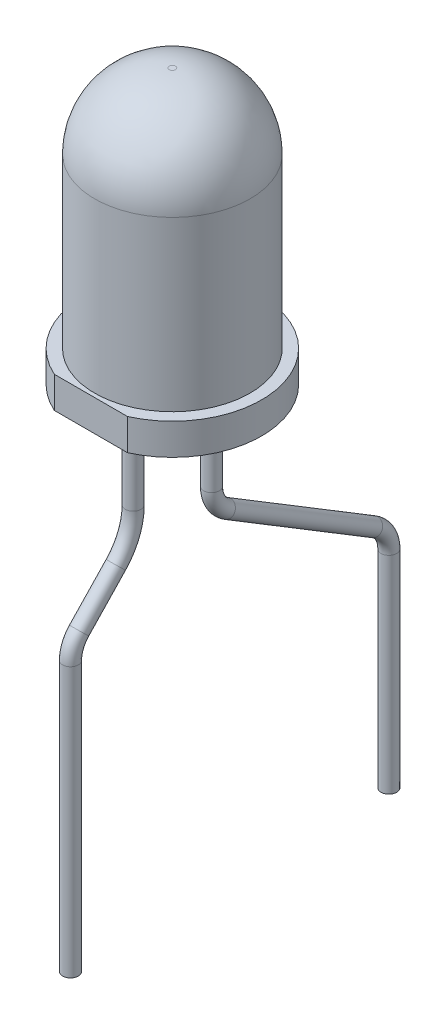
ISO-10303-21;
HEADER;
FILE_DESCRIPTION(('STEP AP214'),'2;1');
FILE_NAME('part.step','',(''),(''),'','','');
FILE_SCHEMA(('AUTOMOTIVE_DESIGN { 1 0 10303 214 1 1 1 1 }'));
ENDSEC;
DATA;
#1=APPLICATION_CONTEXT('core data for automotive mechanical design processes');
#2=APPLICATION_PROTOCOL_DEFINITION('international standard','automotive_design',2000,#1);
#3=PRODUCT_CONTEXT('',#1,'mechanical');
#4=PRODUCT('Part','Part','',(#3));
#5=PRODUCT_RELATED_PRODUCT_CATEGORY('part','',(#4));
#6=PRODUCT_DEFINITION_FORMATION('','',#4);
#7=PRODUCT_DEFINITION_CONTEXT('part definition',#1,'design');
#8=PRODUCT_DEFINITION('design','',#6,#7);
#9=PRODUCT_DEFINITION_SHAPE('','',#8);
#10=(LENGTH_UNIT() NAMED_UNIT(*) SI_UNIT(.MILLI.,.METRE.));
#11=(NAMED_UNIT(*) PLANE_ANGLE_UNIT() SI_UNIT($,.RADIAN.));
#12=(NAMED_UNIT(*) SI_UNIT($,.STERADIAN.) SOLID_ANGLE_UNIT());
#13=UNCERTAINTY_MEASURE_WITH_UNIT(LENGTH_MEASURE(1.E-05),#10,'distance_accuracy_value','');
#14=(GEOMETRIC_REPRESENTATION_CONTEXT(3) GLOBAL_UNCERTAINTY_ASSIGNED_CONTEXT((#13)) GLOBAL_UNIT_ASSIGNED_CONTEXT((#10,
#11,#12)) REPRESENTATION_CONTEXT('',''));
#15=CARTESIAN_POINT('',(0.,0.,0.));
#16=DIRECTION('',(0.,0.,1.));
#17=DIRECTION('',(1.,0.,0.));
#18=AXIS2_PLACEMENT_3D('',#15,#16,#17);
#19=CARTESIAN_POINT('',(0.,0.,0.));
#20=DIRECTION('',(0.,-1.,0.));
#21=DIRECTION('',(0.,0.,-1.));
#22=AXIS2_PLACEMENT_3D('',#19,#20,#21);
#23=PLANE('',#22);
#24=CARTESIAN_POINT('',(0.,0.,1.25));
#25=DIRECTION('',(0.,-1.,0.));
#26=DIRECTION('',(0.,0.,-1.));
#27=AXIS2_PLACEMENT_3D('',#24,#25,#26);
#28=CIRCLE('',#27,0.25);
#29=CARTESIAN_POINT('',(0.,0.,1.));
#30=VERTEX_POINT('',#29);
#31=EDGE_CURVE('E89',#30,#30,#28,.T.);
#32=ORIENTED_EDGE('',*,*,#31,.F.);
#33=EDGE_LOOP('',(#32));
#34=FACE_BOUND('',#33,.T.);
#35=CARTESIAN_POINT('',(0.,0.,-1.25));
#36=DIRECTION('',(0.,-1.,0.));
#37=DIRECTION('',(0.,0.,-1.));
#38=AXIS2_PLACEMENT_3D('',#35,#36,#37);
#39=CIRCLE('',#38,0.25);
#40=CARTESIAN_POINT('',(0.,0.,-1.5));
#41=VERTEX_POINT('',#40);
#42=EDGE_CURVE('E86',#41,#41,#39,.T.);
#43=ORIENTED_EDGE('',*,*,#42,.F.);
#44=EDGE_LOOP('',(#43));
#45=FACE_BOUND('',#44,.T.);
#46=DIRECTION('',(1.,0.,0.));
#47=VECTOR('',#46,1.);
#48=CARTESIAN_POINT('',(-1.16726175299288,0.,2.6));
#49=LINE('',#48,#47);
#50=CARTESIAN_POINT('',(-1.16726175299288,0.,2.6));
#51=VERTEX_POINT('',#50);
#52=CARTESIAN_POINT('',(1.16726175299288,0.,2.6));
#53=VERTEX_POINT('',#52);
#54=EDGE_CURVE('E66',#51,#53,#49,.T.);
#55=ORIENTED_EDGE('',*,*,#54,.F.);
#56=CARTESIAN_POINT('',(0.,0.,0.));
#57=DIRECTION('',(0.,-1.,0.));
#58=DIRECTION('',(0.,0.,-1.));
#59=AXIS2_PLACEMENT_3D('',#56,#57,#58);
#60=CIRCLE('',#59,2.85);
#61=EDGE_CURVE('E11',#51,#53,#60,.T.);
#62=ORIENTED_EDGE('',*,*,#61,.T.);
#63=EDGE_LOOP('',(#55,#62));
#64=FACE_BOUND('',#63,.T.);
#65=ADVANCED_FACE('F37',(#34,#45,#64),#23,.T.);
#66=CARTESIAN_POINT('',(0.,0.,0.));
#67=DIRECTION('',(0.,-1.,0.));
#68=DIRECTION('',(0.,0.,-1.));
#69=AXIS2_PLACEMENT_3D('',#66,#67,#68);
#70=CYLINDRICAL_SURFACE('',#69,2.85);
#71=DIRECTION('',(0.,-1.,0.));
#72=VECTOR('',#71,1.);
#73=CARTESIAN_POINT('',(1.16726175299288,3.34787137637478,2.6));
#74=LINE('',#73,#72);
#75=CARTESIAN_POINT('',(1.16726175299288,1.,2.6));
#76=VERTEX_POINT('',#75);
#77=EDGE_CURVE('E51',#76,#53,#74,.T.);
#78=ORIENTED_EDGE('',*,*,#77,.T.);
#79=ORIENTED_EDGE('',*,*,#61,.F.);
#80=DIRECTION('',(0.,-1.,0.));
#81=VECTOR('',#80,1.);
#82=CARTESIAN_POINT('',(-1.16726175299288,3.34787137637478,2.6));
#83=LINE('',#82,#81);
#84=CARTESIAN_POINT('',(-1.16726175299288,1.,2.6));
#85=VERTEX_POINT('',#84);
#86=EDGE_CURVE('E57',#85,#51,#83,.T.);
#87=ORIENTED_EDGE('',*,*,#86,.F.);
#88=CARTESIAN_POINT('',(0.,1.,0.));
#89=DIRECTION('',(0.,-1.,0.));
#90=DIRECTION('',(0.,0.,-1.));
#91=AXIS2_PLACEMENT_3D('',#88,#89,#90);
#92=CIRCLE('',#91,2.85);
#93=EDGE_CURVE('E44',#85,#76,#92,.T.);
#94=ORIENTED_EDGE('',*,*,#93,.T.);
#95=EDGE_LOOP('',(#78,#79,#87,#94));
#96=FACE_BOUND('',#95,.T.);
#97=ADVANCED_FACE('F70',(#96),#70,.T.);
#98=CARTESIAN_POINT('',(2.85,1.,0.));
#99=DIRECTION('',(0.,1.,0.));
#100=DIRECTION('',(0.,0.,1.));
#101=AXIS2_PLACEMENT_3D('',#98,#99,#100);
#102=PLANE('',#101);
#103=DIRECTION('',(1.,0.,0.));
#104=VECTOR('',#103,1.);
#105=CARTESIAN_POINT('',(-1.16726175299288,1.,2.6));
#106=LINE('',#105,#104);
#107=EDGE_CURVE('E61',#85,#76,#106,.T.);
#108=ORIENTED_EDGE('',*,*,#107,.T.);
#109=ORIENTED_EDGE('',*,*,#93,.F.);
#110=EDGE_LOOP('',(#108,#109));
#111=FACE_BOUND('',#110,.T.);
#112=CARTESIAN_POINT('',(0.,1.,0.));
#113=DIRECTION('',(0.,-1.,0.));
#114=DIRECTION('',(0.,0.,-1.));
#115=AXIS2_PLACEMENT_3D('',#112,#113,#114);
#116=CIRCLE('',#115,2.48);
#117=CARTESIAN_POINT('',(0.,1.,-2.48));
#118=VERTEX_POINT('',#117);
#119=EDGE_CURVE('E75',#118,#118,#116,.T.);
#120=ORIENTED_EDGE('',*,*,#119,.T.);
#121=EDGE_LOOP('',(#120));
#122=FACE_BOUND('',#121,.T.);
#123=ADVANCED_FACE('F73',(#111,#122),#102,.T.);
#124=CARTESIAN_POINT('',(0.,0.,0.));
#125=DIRECTION('',(0.,-1.,0.));
#126=DIRECTION('',(0.,0.,-1.));
#127=AXIS2_PLACEMENT_3D('',#124,#125,#126);
#128=CYLINDRICAL_SURFACE('',#127,2.48);
#129=CARTESIAN_POINT('',(0.,6.37,0.));
#130=DIRECTION('',(0.,-1.,0.));
#131=DIRECTION('',(0.,0.,-1.));
#132=AXIS2_PLACEMENT_3D('',#129,#130,#131);
#133=CIRCLE('',#132,2.48);
#134=CARTESIAN_POINT('',(0.,6.37,-2.48));
#135=VERTEX_POINT('',#134);
#136=EDGE_CURVE('E77',#135,#135,#133,.T.);
#137=ORIENTED_EDGE('',*,*,#136,.T.);
#138=EDGE_LOOP('',(#137));
#139=FACE_BOUND('',#138,.T.);
#140=ORIENTED_EDGE('',*,*,#119,.F.);
#141=EDGE_LOOP('',(#140));
#142=FACE_BOUND('',#141,.T.);
#143=ADVANCED_FACE('F294',(#139,#142),#128,.T.);
#144=CARTESIAN_POINT('',(0.,6.37,0.));
#145=DIRECTION('',(0.,-1.,0.));
#146=DIRECTION('',(0.,0.,-1.));
#147=AXIS2_PLACEMENT_3D('',#144,#145,#146);
#148=DEGENERATE_TOROIDAL_SURFACE('',#147,0.1,2.38,.T.);
#149=CARTESIAN_POINT('',(0.,8.75,0.));
#150=DIRECTION('',(0.,-1.,0.));
#151=DIRECTION('',(0.,0.,-1.));
#152=AXIS2_PLACEMENT_3D('',#149,#150,#151);
#153=CIRCLE('',#152,0.1);
#154=CARTESIAN_POINT('',(0.,8.75,-0.1));
#155=VERTEX_POINT('',#154);
#156=EDGE_CURVE('E71',#155,#155,#153,.T.);
#157=ORIENTED_EDGE('',*,*,#156,.T.);
#158=EDGE_LOOP('',(#157));
#159=FACE_BOUND('',#158,.T.);
#160=ORIENTED_EDGE('',*,*,#136,.F.);
#161=EDGE_LOOP('',(#160));
#162=FACE_BOUND('',#161,.T.);
#163=ADVANCED_FACE('F308',(#159,#162),#148,.T.);
#164=CARTESIAN_POINT('',(0.,8.75,0.));
#165=DIRECTION('',(0.,1.,0.));
#166=DIRECTION('',(0.,0.,1.));
#167=AXIS2_PLACEMENT_3D('',#164,#165,#166);
#168=PLANE('',#167);
#169=ORIENTED_EDGE('',*,*,#156,.F.);
#170=EDGE_LOOP('',(#169));
#171=FACE_BOUND('',#170,.T.);
#172=ADVANCED_FACE('F138',(#171),#168,.T.);
#173=CARTESIAN_POINT('',(-1.16726175299288,3.34787137637478,2.6));
#174=DIRECTION('',(0.,0.,-1.));
#175=DIRECTION('',(-1.,0.,0.));
#176=AXIS2_PLACEMENT_3D('',#173,#174,#175);
#177=PLANE('',#176);
#178=ORIENTED_EDGE('',*,*,#86,.T.);
#179=ORIENTED_EDGE('',*,*,#54,.T.);
#180=ORIENTED_EDGE('',*,*,#77,.F.);
#181=ORIENTED_EDGE('',*,*,#107,.F.);
#182=EDGE_LOOP('',(#178,#179,#180,#181));
#183=FACE_BOUND('',#182,.T.);
#184=ADVANCED_FACE('F62',(#183),#177,.F.);
#185=CARTESIAN_POINT('',(0.,-2.,-1.25));
#186=DIRECTION('',(0.,1.,0.));
#187=DIRECTION('',(0.,0.,1.));
#188=AXIS2_PLACEMENT_3D('',#185,#186,#187);
#189=CYLINDRICAL_SURFACE('',#188,0.25);
#190=ORIENTED_EDGE('',*,*,#42,.T.);
#191=EDGE_LOOP('',(#190));
#192=FACE_BOUND('',#191,.T.);
#193=CARTESIAN_POINT('',(0.,-3.43733882567167,-1.25));
#194=DIRECTION('',(0.,-1.,0.));
#195=DIRECTION('',(0.,0.,-1.));
#196=AXIS2_PLACEMENT_3D('',#193,#194,#195);
#197=CIRCLE('',#196,0.25);
#198=CARTESIAN_POINT('',(0.,-3.43733882567167,-1.));
#199=VERTEX_POINT('',#198);
#200=EDGE_CURVE('E119',#199,#199,#197,.T.);
#201=ORIENTED_EDGE('',*,*,#200,.F.);
#202=EDGE_LOOP('',(#201));
#203=FACE_BOUND('',#202,.T.);
#204=ADVANCED_FACE('F125',(#192,#203),#189,.T.);
#205=CARTESIAN_POINT('',(0.,-2.,1.25));
#206=DIRECTION('',(0.,1.,0.));
#207=DIRECTION('',(0.,0.,1.));
#208=AXIS2_PLACEMENT_3D('',#205,#206,#207);
#209=CYLINDRICAL_SURFACE('',#208,0.25);
#210=ORIENTED_EDGE('',*,*,#31,.T.);
#211=EDGE_LOOP('',(#210));
#212=FACE_BOUND('',#211,.T.);
#213=CARTESIAN_POINT('',(0.,-2.7,1.25));
#214=DIRECTION('',(0.,-1.,0.));
#215=DIRECTION('',(0.,0.,-1.));
#216=AXIS2_PLACEMENT_3D('',#213,#214,#215);
#217=CIRCLE('',#216,0.25);
#218=CARTESIAN_POINT('',(0.,-2.7,1.));
#219=VERTEX_POINT('',#218);
#220=EDGE_CURVE('E104',#219,#219,#217,.T.);
#221=ORIENTED_EDGE('',*,*,#220,.F.);
#222=EDGE_LOOP('',(#221));
#223=FACE_BOUND('',#222,.T.);
#224=ADVANCED_FACE('F127',(#212,#223),#209,.T.);
#225=CARTESIAN_POINT('',(0.,-14.6,3.25));
#226=DIRECTION('',(0.,-1.,0.));
#227=DIRECTION('',(0.,0.,-1.));
#228=AXIS2_PLACEMENT_3D('',#225,#226,#227);
#229=PLANE('',#228);
#230=CARTESIAN_POINT('',(0.,-14.6,3.25));
#231=DIRECTION('',(0.,-1.,0.));
#232=DIRECTION('',(0.,0.,-1.));
#233=AXIS2_PLACEMENT_3D('',#230,#231,#232);
#234=CIRCLE('',#233,0.25);
#235=CARTESIAN_POINT('',(0.,-14.6,3.));
#236=VERTEX_POINT('',#235);
#237=EDGE_CURVE('E92',#236,#236,#234,.T.);
#238=ORIENTED_EDGE('',*,*,#237,.T.);
#239=EDGE_LOOP('',(#238));
#240=FACE_BOUND('',#239,.T.);
#241=ADVANCED_FACE('F134',(#240),#229,.T.);
#242=CARTESIAN_POINT('',(0.,-2.7,3.25));
#243=DIRECTION('',(-1.,0.,0.));
#244=DIRECTION('',(0.,0.,1.));
#245=AXIS2_PLACEMENT_3D('',#242,#243,#244);
#246=TOROIDAL_SURFACE('',#245,2.,0.25);
#247=CARTESIAN_POINT('',(0.,-4.07931034482759,1.80172413793103));
#248=DIRECTION('',(0.,-0.724137931034485,0.689655172413791));
#249=DIRECTION('',(0.,-0.689655172413791,-0.724137931034485));
#250=AXIS2_PLACEMENT_3D('',#247,#248,#249);
#251=CIRCLE('',#250,0.25);
#252=CARTESIAN_POINT('',(0.,-4.25172413793103,1.62068965517241));
#253=VERTEX_POINT('',#252);
#254=EDGE_CURVE('E101',#253,#253,#251,.T.);
#255=CARTESIAN_POINT('',(0.,-2.7,3.25));
#256=DIRECTION('',(-1.,0.,0.));
#257=DIRECTION('',(0.,0.,1.));
#258=AXIS2_PLACEMENT_3D('',#255,#256,#257);
#259=CIRCLE('',#258,2.25);
#260=EDGE_CURVE('',#219,#253,#259,.T.);
#261=ORIENTED_EDGE('',*,*,#220,.T.);
#262=ORIENTED_EDGE('',*,*,#254,.F.);
#263=ORIENTED_EDGE('',*,*,#260,.T.);
#264=ORIENTED_EDGE('',*,*,#260,.F.);
#265=EDGE_LOOP('',(#261,#263,#262,#264));
#266=FACE_BOUND('',#265,.T.);
#267=ADVANCED_FACE('F152',(#266),#246,.T.);
#268=CARTESIAN_POINT('',(0.,-4.07931034482759,1.80172413793103));
#269=DIRECTION('',(0.,-0.724137931034485,0.689655172413791));
#270=DIRECTION('',(0.,-0.689655172413791,-0.724137931034485));
#271=AXIS2_PLACEMENT_3D('',#268,#269,#270);
#272=CYLINDRICAL_SURFACE('',#271,0.25);
#273=CARTESIAN_POINT('',(0.,-5.31034482758622,2.97413793103448));
#274=DIRECTION('',(0.,-0.724137931034485,0.689655172413791));
#275=DIRECTION('',(0.,-0.689655172413791,-0.724137931034485));
#276=AXIS2_PLACEMENT_3D('',#273,#274,#275);
#277=CIRCLE('',#276,0.25);
#278=CARTESIAN_POINT('',(0.,-5.13793103448277,3.1551724137931));
#279=VERTEX_POINT('',#278);
#280=EDGE_CURVE('E98',#279,#279,#277,.T.);
#281=ORIENTED_EDGE('',*,*,#280,.F.);
#282=EDGE_LOOP('',(#281));
#283=FACE_BOUND('',#282,.T.);
#284=ORIENTED_EDGE('',*,*,#254,.T.);
#285=EDGE_LOOP('',(#284));
#286=FACE_BOUND('',#285,.T.);
#287=ADVANCED_FACE('F154',(#283,#286),#272,.T.);
#288=CARTESIAN_POINT('',(0.,-6.00000000000001,2.25));
#289=DIRECTION('',(1.,0.,0.));
#290=DIRECTION('',(0.,0.,-1.));
#291=AXIS2_PLACEMENT_3D('',#288,#289,#290);
#292=TOROIDAL_SURFACE('',#291,0.999999999999997,0.25);
#293=CARTESIAN_POINT('',(0.,-6.00000000000001,3.25));
#294=DIRECTION('',(0.,-1.,0.));
#295=DIRECTION('',(0.,0.,-1.));
#296=AXIS2_PLACEMENT_3D('',#293,#294,#295);
#297=CIRCLE('',#296,0.25);
#298=CARTESIAN_POINT('',(0.,-6.00000000000001,3.5));
#299=VERTEX_POINT('',#298);
#300=EDGE_CURVE('E95',#299,#299,#297,.T.);
#301=CARTESIAN_POINT('',(0.,-6.00000000000001,2.25));
#302=DIRECTION('',(1.,0.,0.));
#303=DIRECTION('',(0.,0.,-1.));
#304=AXIS2_PLACEMENT_3D('',#301,#302,#303);
#305=CIRCLE('',#304,1.25);
#306=EDGE_CURVE('',#279,#299,#305,.T.);
#307=ORIENTED_EDGE('',*,*,#280,.T.);
#308=ORIENTED_EDGE('',*,*,#300,.F.);
#309=ORIENTED_EDGE('',*,*,#306,.T.);
#310=ORIENTED_EDGE('',*,*,#306,.F.);
#311=EDGE_LOOP('',(#307,#309,#308,#310));
#312=FACE_BOUND('',#311,.T.);
#313=ADVANCED_FACE('F161',(#312),#292,.T.);
#314=CARTESIAN_POINT('',(0.,-6.00000000000001,3.25));
#315=DIRECTION('',(0.,-1.,0.));
#316=DIRECTION('',(0.,0.,-1.));
#317=AXIS2_PLACEMENT_3D('',#314,#315,#316);
#318=CYLINDRICAL_SURFACE('',#317,0.25);
#319=ORIENTED_EDGE('',*,*,#237,.F.);
#320=EDGE_LOOP('',(#319));
#321=FACE_BOUND('',#320,.T.);
#322=ORIENTED_EDGE('',*,*,#300,.T.);
#323=EDGE_LOOP('',(#322));
#324=FACE_BOUND('',#323,.T.);
#325=ADVANCED_FACE('F137',(#321,#324),#318,.T.);
#326=CARTESIAN_POINT('',(0.,-14.6,-6.91));
#327=DIRECTION('',(0.,-1.,0.));
#328=DIRECTION('',(0.,0.,-1.));
#329=AXIS2_PLACEMENT_3D('',#326,#327,#328);
#330=PLANE('',#329);
#331=CARTESIAN_POINT('',(0.,-14.6,-6.91));
#332=DIRECTION('',(0.,-1.,0.));
#333=DIRECTION('',(0.,0.,-1.));
#334=AXIS2_PLACEMENT_3D('',#331,#332,#333);
#335=CIRCLE('',#334,0.25);
#336=CARTESIAN_POINT('',(0.,-14.6,-7.16));
#337=VERTEX_POINT('',#336);
#338=EDGE_CURVE('E107',#337,#337,#335,.T.);
#339=ORIENTED_EDGE('',*,*,#338,.T.);
#340=EDGE_LOOP('',(#339));
#341=FACE_BOUND('',#340,.T.);
#342=ADVANCED_FACE('F169',(#341),#330,.T.);
#343=CARTESIAN_POINT('',(0.,-3.43733882567167,-2.25));
#344=DIRECTION('',(1.,0.,0.));
#345=DIRECTION('',(0.,0.,-1.));
#346=AXIS2_PLACEMENT_3D('',#343,#344,#345);
#347=TOROIDAL_SURFACE('',#346,0.999999999999998,0.25);
#348=CARTESIAN_POINT('',(0.,-4.29206535593698,-1.73092143324866));
#349=DIRECTION('',(0.,-0.519078566751339,-0.85472653026531));
#350=DIRECTION('',(0.,0.85472653026531,-0.519078566751339));
#351=AXIS2_PLACEMENT_3D('',#348,#349,#350);
#352=CIRCLE('',#351,0.25);
#353=CARTESIAN_POINT('',(0.,-4.5057469885033,-1.60115179156083));
#354=VERTEX_POINT('',#353);
#355=EDGE_CURVE('E116',#354,#354,#352,.T.);
#356=CARTESIAN_POINT('',(0.,-3.43733882567167,-2.25));
#357=DIRECTION('',(1.,0.,0.));
#358=DIRECTION('',(0.,0.,-1.));
#359=AXIS2_PLACEMENT_3D('',#356,#357,#358);
#360=CIRCLE('',#359,1.25);
#361=EDGE_CURVE('',#199,#354,#360,.T.);
#362=ORIENTED_EDGE('',*,*,#200,.T.);
#363=ORIENTED_EDGE('',*,*,#355,.F.);
#364=ORIENTED_EDGE('',*,*,#361,.T.);
#365=ORIENTED_EDGE('',*,*,#361,.F.);
#366=EDGE_LOOP('',(#362,#364,#363,#365));
#367=FACE_BOUND('',#366,.T.);
#368=ADVANCED_FACE('F123',(#367),#347,.T.);
#369=CARTESIAN_POINT('',(0.,-4.29206535593698,-1.73092143324866));
#370=DIRECTION('',(0.,-0.519078566751339,-0.85472653026531));
#371=DIRECTION('',(0.,0.85472653026531,-0.519078566751339));
#372=AXIS2_PLACEMENT_3D('',#369,#370,#371);
#373=CYLINDRICAL_SURFACE('',#372,0.25);
#374=CARTESIAN_POINT('',(0.,-7.14527346973469,-6.42907856675134));
#375=DIRECTION('',(0.,-0.519078566751339,-0.85472653026531));
#376=DIRECTION('',(0.,0.85472653026531,-0.519078566751339));
#377=AXIS2_PLACEMENT_3D('',#374,#375,#376);
#378=CIRCLE('',#377,0.25);
#379=CARTESIAN_POINT('',(0.,-6.93159183716836,-6.55884820843917));
#380=VERTEX_POINT('',#379);
#381=EDGE_CURVE('E113',#380,#380,#378,.T.);
#382=ORIENTED_EDGE('',*,*,#381,.F.);
#383=EDGE_LOOP('',(#382));
#384=FACE_BOUND('',#383,.T.);
#385=ORIENTED_EDGE('',*,*,#355,.T.);
#386=EDGE_LOOP('',(#385));
#387=FACE_BOUND('',#386,.T.);
#388=ADVANCED_FACE('F190',(#384,#387),#373,.T.);
#389=CARTESIAN_POINT('',(0.,-8.,-5.91));
#390=DIRECTION('',(-1.,0.,0.));
#391=DIRECTION('',(0.,0.,1.));
#392=AXIS2_PLACEMENT_3D('',#389,#390,#391);
#393=TOROIDAL_SURFACE('',#392,0.999999999999999,0.25);
#394=CARTESIAN_POINT('',(0.,-8.,-6.91));
#395=DIRECTION('',(0.,-1.,0.));
#396=DIRECTION('',(0.,0.,-1.));
#397=AXIS2_PLACEMENT_3D('',#394,#395,#396);
#398=CIRCLE('',#397,0.25);
#399=CARTESIAN_POINT('',(0.,-8.,-7.16));
#400=VERTEX_POINT('',#399);
#401=EDGE_CURVE('E110',#400,#400,#398,.T.);
#402=CARTESIAN_POINT('',(0.,-8.,-5.91));
#403=DIRECTION('',(-1.,0.,0.));
#404=DIRECTION('',(0.,0.,1.));
#405=AXIS2_PLACEMENT_3D('',#402,#403,#404);
#406=CIRCLE('',#405,1.25);
#407=EDGE_CURVE('',#380,#400,#406,.T.);
#408=ORIENTED_EDGE('',*,*,#381,.T.);
#409=ORIENTED_EDGE('',*,*,#401,.F.);
#410=ORIENTED_EDGE('',*,*,#407,.T.);
#411=ORIENTED_EDGE('',*,*,#407,.F.);
#412=EDGE_LOOP('',(#408,#410,#409,#411));
#413=FACE_BOUND('',#412,.T.);
#414=ADVANCED_FACE('F197',(#413),#393,.T.);
#415=CARTESIAN_POINT('',(0.,-8.,-6.91));
#416=DIRECTION('',(0.,-1.,0.));
#417=DIRECTION('',(0.,0.,-1.));
#418=AXIS2_PLACEMENT_3D('',#415,#416,#417);
#419=CYLINDRICAL_SURFACE('',#418,0.25);
#420=ORIENTED_EDGE('',*,*,#338,.F.);
#421=EDGE_LOOP('',(#420));
#422=FACE_BOUND('',#421,.T.);
#423=ORIENTED_EDGE('',*,*,#401,.T.);
#424=EDGE_LOOP('',(#423));
#425=FACE_BOUND('',#424,.T.);
#426=ADVANCED_FACE('F166',(#422,#425),#419,.T.);
#427=CLOSED_SHELL('',(#65,#97,#123,#143,#163,#172,#184,#204,#224,#241,#267,#287,#313,#325,#342,
#368,#388,#414,#426));
#428=MANIFOLD_SOLID_BREP('B2',#427);
#429=ADVANCED_BREP_SHAPE_REPRESENTATION('',(#18,#428),#14);
#430=SHAPE_DEFINITION_REPRESENTATION(#9,#429);
ENDSEC;
END-ISO-10303-21;
